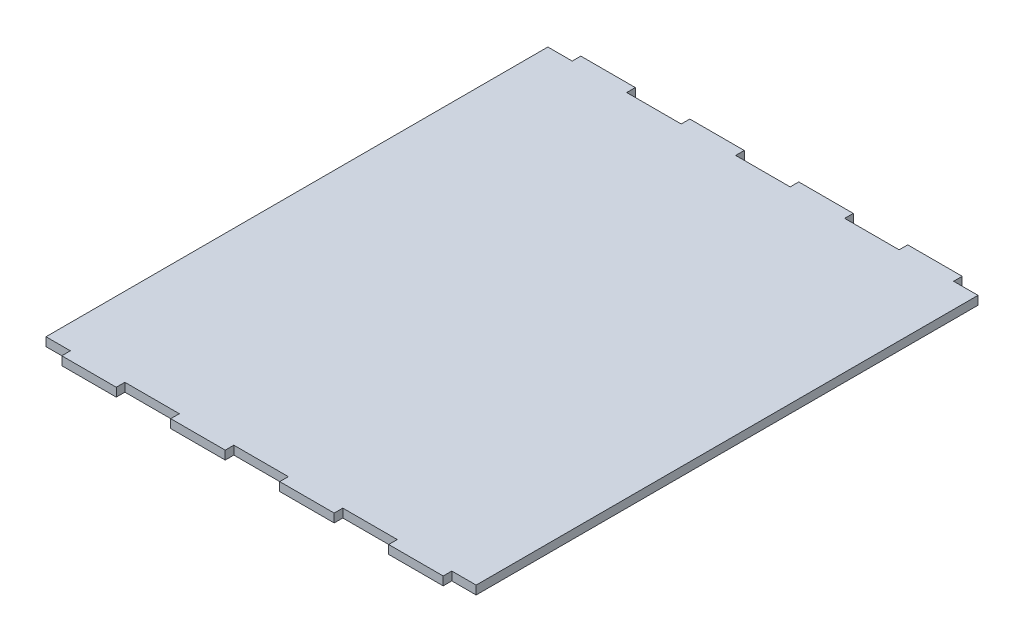
ISO-10303-21;
HEADER;
FILE_DESCRIPTION(('STEP AP214'),'2;1');
FILE_NAME('part.step','',(''),(''),'','','');
FILE_SCHEMA(('AUTOMOTIVE_DESIGN { 1 0 10303 214 1 1 1 1 }'));
ENDSEC;
DATA;
#1=APPLICATION_CONTEXT('core data for automotive mechanical design processes');
#2=APPLICATION_PROTOCOL_DEFINITION('international standard','automotive_design',2000,#1);
#3=PRODUCT_CONTEXT('',#1,'mechanical');
#4=PRODUCT('Part','Part','',(#3));
#5=PRODUCT_RELATED_PRODUCT_CATEGORY('part','',(#4));
#6=PRODUCT_DEFINITION_FORMATION('','',#4);
#7=PRODUCT_DEFINITION_CONTEXT('part definition',#1,'design');
#8=PRODUCT_DEFINITION('design','',#6,#7);
#9=PRODUCT_DEFINITION_SHAPE('','',#8);
#10=(LENGTH_UNIT() NAMED_UNIT(*) SI_UNIT(.MILLI.,.METRE.));
#11=(NAMED_UNIT(*) PLANE_ANGLE_UNIT() SI_UNIT($,.RADIAN.));
#12=(NAMED_UNIT(*) SI_UNIT($,.STERADIAN.) SOLID_ANGLE_UNIT());
#13=UNCERTAINTY_MEASURE_WITH_UNIT(LENGTH_MEASURE(1.E-05),#10,'distance_accuracy_value','');
#14=(GEOMETRIC_REPRESENTATION_CONTEXT(3) GLOBAL_UNCERTAINTY_ASSIGNED_CONTEXT((#13)) GLOBAL_UNIT_ASSIGNED_CONTEXT((#10,
#11,#12)) REPRESENTATION_CONTEXT('',''));
#15=CARTESIAN_POINT('',(0.,0.,0.));
#16=DIRECTION('',(0.,0.,1.));
#17=DIRECTION('',(1.,0.,0.));
#18=AXIS2_PLACEMENT_3D('',#15,#16,#17);
#19=CARTESIAN_POINT('',(0.,3.,-3.));
#20=DIRECTION('',(0.,0.,-1.));
#21=DIRECTION('',(-1.,0.,0.));
#22=AXIS2_PLACEMENT_3D('',#19,#20,#21);
#23=PLANE('',#22);
#24=DIRECTION('',(1.,0.,0.));
#25=VECTOR('',#24,1.);
#26=CARTESIAN_POINT('',(0.,0.,-3.));
#27=LINE('',#26,#25);
#28=CARTESIAN_POINT('',(0.,0.,-3.));
#29=VERTEX_POINT('',#28);
#30=CARTESIAN_POINT('',(8.5,0.,-3.));
#31=VERTEX_POINT('',#30);
#32=EDGE_CURVE('E306',#29,#31,#27,.T.);
#33=ORIENTED_EDGE('',*,*,#32,.T.);
#34=DIRECTION('',(0.,-1.,0.));
#35=VECTOR('',#34,1.);
#36=CARTESIAN_POINT('',(8.5,3.,-3.));
#37=LINE('',#36,#35);
#38=CARTESIAN_POINT('',(8.5,3.,-3.));
#39=VERTEX_POINT('',#38);
#40=EDGE_CURVE('E11',#39,#31,#37,.T.);
#41=ORIENTED_EDGE('',*,*,#40,.F.);
#42=DIRECTION('',(1.,0.,0.));
#43=VECTOR('',#42,1.);
#44=CARTESIAN_POINT('',(0.,3.,-3.));
#45=LINE('',#44,#43);
#46=CARTESIAN_POINT('',(0.,3.,-3.));
#47=VERTEX_POINT('',#46);
#48=EDGE_CURVE('E178',#47,#39,#45,.T.);
#49=ORIENTED_EDGE('',*,*,#48,.F.);
#50=DIRECTION('',(0.,-1.,0.));
#51=VECTOR('',#50,1.);
#52=CARTESIAN_POINT('',(0.,3.,-3.));
#53=LINE('',#52,#51);
#54=EDGE_CURVE('E56',#47,#29,#53,.T.);
#55=ORIENTED_EDGE('',*,*,#54,.T.);
#56=EDGE_LOOP('',(#33,#41,#49,#55));
#57=FACE_BOUND('',#56,.T.);
#58=ADVANCED_FACE('F39',(#57),#23,.F.);
#59=CARTESIAN_POINT('',(8.5,3.,0.));
#60=DIRECTION('',(-1.,0.,0.));
#61=DIRECTION('',(0.,0.,1.));
#62=AXIS2_PLACEMENT_3D('',#59,#60,#61);
#63=PLANE('',#62);
#64=DIRECTION('',(0.,0.,-1.));
#65=VECTOR('',#64,1.);
#66=CARTESIAN_POINT('',(8.5,0.,0.));
#67=LINE('',#66,#65);
#68=CARTESIAN_POINT('',(8.5,0.,0.));
#69=VERTEX_POINT('',#68);
#70=EDGE_CURVE('E309',#69,#31,#67,.T.);
#71=ORIENTED_EDGE('',*,*,#70,.F.);
#72=DIRECTION('',(0.,-1.,0.));
#73=VECTOR('',#72,1.);
#74=CARTESIAN_POINT('',(8.5,3.,0.));
#75=LINE('',#74,#73);
#76=CARTESIAN_POINT('',(8.5,3.,0.));
#77=VERTEX_POINT('',#76);
#78=EDGE_CURVE('E48',#77,#69,#75,.T.);
#79=ORIENTED_EDGE('',*,*,#78,.F.);
#80=DIRECTION('',(0.,0.,-1.));
#81=VECTOR('',#80,1.);
#82=CARTESIAN_POINT('',(8.5,3.,0.));
#83=LINE('',#82,#81);
#84=EDGE_CURVE('E556',#77,#39,#83,.T.);
#85=ORIENTED_EDGE('',*,*,#84,.T.);
#86=ORIENTED_EDGE('',*,*,#40,.T.);
#87=EDGE_LOOP('',(#71,#79,#85,#86));
#88=FACE_BOUND('',#87,.T.);
#89=ADVANCED_FACE('F555',(#88),#63,.T.);
#90=CARTESIAN_POINT('',(8.5,3.,0.));
#91=DIRECTION('',(0.,0.,-1.));
#92=DIRECTION('',(-1.,0.,0.));
#93=AXIS2_PLACEMENT_3D('',#90,#91,#92);
#94=PLANE('',#93);
#95=DIRECTION('',(1.,0.,0.));
#96=VECTOR('',#95,1.);
#97=CARTESIAN_POINT('',(8.5,0.,0.));
#98=LINE('',#97,#96);
#99=CARTESIAN_POINT('',(27.5,0.,0.));
#100=VERTEX_POINT('',#99);
#101=EDGE_CURVE('E313',#69,#100,#98,.T.);
#102=ORIENTED_EDGE('',*,*,#101,.T.);
#103=DIRECTION('',(0.,-1.,0.));
#104=VECTOR('',#103,1.);
#105=CARTESIAN_POINT('',(27.5,3.,0.));
#106=LINE('',#105,#104);
#107=CARTESIAN_POINT('',(27.5,3.,0.));
#108=VERTEX_POINT('',#107);
#109=EDGE_CURVE('E538',#108,#100,#106,.T.);
#110=ORIENTED_EDGE('',*,*,#109,.F.);
#111=DIRECTION('',(1.,0.,0.));
#112=VECTOR('',#111,1.);
#113=CARTESIAN_POINT('',(8.5,3.,0.));
#114=LINE('',#113,#112);
#115=EDGE_CURVE('E547',#77,#108,#114,.T.);
#116=ORIENTED_EDGE('',*,*,#115,.F.);
#117=ORIENTED_EDGE('',*,*,#78,.T.);
#118=EDGE_LOOP('',(#102,#110,#116,#117));
#119=FACE_BOUND('',#118,.T.);
#120=ADVANCED_FACE('F545',(#119),#94,.F.);
#121=CARTESIAN_POINT('',(27.5,3.,0.));
#122=DIRECTION('',(-1.,0.,0.));
#123=DIRECTION('',(0.,0.,1.));
#124=AXIS2_PLACEMENT_3D('',#121,#122,#123);
#125=PLANE('',#124);
#126=DIRECTION('',(0.,0.,-1.));
#127=VECTOR('',#126,1.);
#128=CARTESIAN_POINT('',(27.5,0.,0.));
#129=LINE('',#128,#127);
#130=CARTESIAN_POINT('',(27.5,0.,-3.));
#131=VERTEX_POINT('',#130);
#132=EDGE_CURVE('E316',#100,#131,#129,.T.);
#133=ORIENTED_EDGE('',*,*,#132,.T.);
#134=DIRECTION('',(0.,-1.,0.));
#135=VECTOR('',#134,1.);
#136=CARTESIAN_POINT('',(27.5,3.,-3.));
#137=LINE('',#136,#135);
#138=CARTESIAN_POINT('',(27.5,3.,-3.));
#139=VERTEX_POINT('',#138);
#140=EDGE_CURVE('E534',#139,#131,#137,.T.);
#141=ORIENTED_EDGE('',*,*,#140,.F.);
#142=DIRECTION('',(0.,0.,-1.));
#143=VECTOR('',#142,1.);
#144=CARTESIAN_POINT('',(27.5,3.,0.));
#145=LINE('',#144,#143);
#146=EDGE_CURVE('E1029',#108,#139,#145,.T.);
#147=ORIENTED_EDGE('',*,*,#146,.F.);
#148=ORIENTED_EDGE('',*,*,#109,.T.);
#149=EDGE_LOOP('',(#133,#141,#147,#148));
#150=FACE_BOUND('',#149,.T.);
#151=ADVANCED_FACE('F574',(#150),#125,.F.);
#152=CARTESIAN_POINT('',(27.5,3.,-3.));
#153=DIRECTION('',(0.,0.,-1.));
#154=DIRECTION('',(-1.,0.,0.));
#155=AXIS2_PLACEMENT_3D('',#152,#153,#154);
#156=PLANE('',#155);
#157=DIRECTION('',(1.,0.,0.));
#158=VECTOR('',#157,1.);
#159=CARTESIAN_POINT('',(27.5,0.,-3.));
#160=LINE('',#159,#158);
#161=CARTESIAN_POINT('',(46.5,0.,-3.));
#162=VERTEX_POINT('',#161);
#163=EDGE_CURVE('E319',#131,#162,#160,.T.);
#164=ORIENTED_EDGE('',*,*,#163,.T.);
#165=DIRECTION('',(0.,-1.,0.));
#166=VECTOR('',#165,1.);
#167=CARTESIAN_POINT('',(46.5,3.,-3.));
#168=LINE('',#167,#166);
#169=CARTESIAN_POINT('',(46.5,3.,-3.));
#170=VERTEX_POINT('',#169);
#171=EDGE_CURVE('E531',#170,#162,#168,.T.);
#172=ORIENTED_EDGE('',*,*,#171,.F.);
#173=DIRECTION('',(1.,0.,0.));
#174=VECTOR('',#173,1.);
#175=CARTESIAN_POINT('',(27.5,3.,-3.));
#176=LINE('',#175,#174);
#177=EDGE_CURVE('E1027',#139,#170,#176,.T.);
#178=ORIENTED_EDGE('',*,*,#177,.F.);
#179=ORIENTED_EDGE('',*,*,#140,.T.);
#180=EDGE_LOOP('',(#164,#172,#178,#179));
#181=FACE_BOUND('',#180,.T.);
#182=ADVANCED_FACE('F579',(#181),#156,.F.);
#183=CARTESIAN_POINT('',(46.5,3.,0.));
#184=DIRECTION('',(-1.,0.,0.));
#185=DIRECTION('',(0.,0.,1.));
#186=AXIS2_PLACEMENT_3D('',#183,#184,#185);
#187=PLANE('',#186);
#188=DIRECTION('',(0.,0.,-1.));
#189=VECTOR('',#188,1.);
#190=CARTESIAN_POINT('',(46.5,0.,0.));
#191=LINE('',#190,#189);
#192=CARTESIAN_POINT('',(46.5,0.,0.));
#193=VERTEX_POINT('',#192);
#194=EDGE_CURVE('E323',#193,#162,#191,.T.);
#195=ORIENTED_EDGE('',*,*,#194,.F.);
#196=DIRECTION('',(0.,-1.,0.));
#197=VECTOR('',#196,1.);
#198=CARTESIAN_POINT('',(46.5,3.,0.));
#199=LINE('',#198,#197);
#200=CARTESIAN_POINT('',(46.5,3.,0.));
#201=VERTEX_POINT('',#200);
#202=EDGE_CURVE('E528',#201,#193,#199,.T.);
#203=ORIENTED_EDGE('',*,*,#202,.F.);
#204=DIRECTION('',(0.,0.,-1.));
#205=VECTOR('',#204,1.);
#206=CARTESIAN_POINT('',(46.5,3.,0.));
#207=LINE('',#206,#205);
#208=EDGE_CURVE('E1024',#201,#170,#207,.T.);
#209=ORIENTED_EDGE('',*,*,#208,.T.);
#210=ORIENTED_EDGE('',*,*,#171,.T.);
#211=EDGE_LOOP('',(#195,#203,#209,#210));
#212=FACE_BOUND('',#211,.T.);
#213=ADVANCED_FACE('F583',(#212),#187,.T.);
#214=CARTESIAN_POINT('',(46.5,3.,0.));
#215=DIRECTION('',(0.,0.,-1.));
#216=DIRECTION('',(-1.,0.,0.));
#217=AXIS2_PLACEMENT_3D('',#214,#215,#216);
#218=PLANE('',#217);
#219=DIRECTION('',(1.,0.,0.));
#220=VECTOR('',#219,1.);
#221=CARTESIAN_POINT('',(46.5,0.,0.));
#222=LINE('',#221,#220);
#223=CARTESIAN_POINT('',(65.5,0.,0.));
#224=VERTEX_POINT('',#223);
#225=EDGE_CURVE('E327',#193,#224,#222,.T.);
#226=ORIENTED_EDGE('',*,*,#225,.T.);
#227=DIRECTION('',(0.,-1.,0.));
#228=VECTOR('',#227,1.);
#229=CARTESIAN_POINT('',(65.5,3.,0.));
#230=LINE('',#229,#228);
#231=CARTESIAN_POINT('',(65.5,3.,0.));
#232=VERTEX_POINT('',#231);
#233=EDGE_CURVE('E524',#232,#224,#230,.T.);
#234=ORIENTED_EDGE('',*,*,#233,.F.);
#235=DIRECTION('',(1.,0.,0.));
#236=VECTOR('',#235,1.);
#237=CARTESIAN_POINT('',(46.5,3.,0.));
#238=LINE('',#237,#236);
#239=EDGE_CURVE('E1019',#201,#232,#238,.T.);
#240=ORIENTED_EDGE('',*,*,#239,.F.);
#241=ORIENTED_EDGE('',*,*,#202,.T.);
#242=EDGE_LOOP('',(#226,#234,#240,#241));
#243=FACE_BOUND('',#242,.T.);
#244=ADVANCED_FACE('F587',(#243),#218,.F.);
#245=CARTESIAN_POINT('',(65.5,3.,0.));
#246=DIRECTION('',(-1.,0.,0.));
#247=DIRECTION('',(0.,0.,1.));
#248=AXIS2_PLACEMENT_3D('',#245,#246,#247);
#249=PLANE('',#248);
#250=DIRECTION('',(0.,0.,-1.));
#251=VECTOR('',#250,1.);
#252=CARTESIAN_POINT('',(65.5,0.,0.));
#253=LINE('',#252,#251);
#254=CARTESIAN_POINT('',(65.5,0.,-3.));
#255=VERTEX_POINT('',#254);
#256=EDGE_CURVE('E330',#224,#255,#253,.T.);
#257=ORIENTED_EDGE('',*,*,#256,.T.);
#258=DIRECTION('',(0.,-1.,0.));
#259=VECTOR('',#258,1.);
#260=CARTESIAN_POINT('',(65.5,3.,-3.));
#261=LINE('',#260,#259);
#262=CARTESIAN_POINT('',(65.5,3.,-3.));
#263=VERTEX_POINT('',#262);
#264=EDGE_CURVE('E520',#263,#255,#261,.T.);
#265=ORIENTED_EDGE('',*,*,#264,.F.);
#266=DIRECTION('',(0.,0.,-1.));
#267=VECTOR('',#266,1.);
#268=CARTESIAN_POINT('',(65.5,3.,0.));
#269=LINE('',#268,#267);
#270=EDGE_CURVE('E1016',#232,#263,#269,.T.);
#271=ORIENTED_EDGE('',*,*,#270,.F.);
#272=ORIENTED_EDGE('',*,*,#233,.T.);
#273=EDGE_LOOP('',(#257,#265,#271,#272));
#274=FACE_BOUND('',#273,.T.);
#275=ADVANCED_FACE('F591',(#274),#249,.F.);
#276=CARTESIAN_POINT('',(65.5,3.,-3.));
#277=DIRECTION('',(0.,0.,-1.));
#278=DIRECTION('',(-1.,0.,0.));
#279=AXIS2_PLACEMENT_3D('',#276,#277,#278);
#280=PLANE('',#279);
#281=DIRECTION('',(1.,0.,0.));
#282=VECTOR('',#281,1.);
#283=CARTESIAN_POINT('',(65.5,0.,-3.));
#284=LINE('',#283,#282);
#285=CARTESIAN_POINT('',(84.5,0.,-3.));
#286=VERTEX_POINT('',#285);
#287=EDGE_CURVE('E333',#255,#286,#284,.T.);
#288=ORIENTED_EDGE('',*,*,#287,.T.);
#289=DIRECTION('',(0.,-1.,0.));
#290=VECTOR('',#289,1.);
#291=CARTESIAN_POINT('',(84.5,3.,-3.));
#292=LINE('',#291,#290);
#293=CARTESIAN_POINT('',(84.5,3.,-3.));
#294=VERTEX_POINT('',#293);
#295=EDGE_CURVE('E517',#294,#286,#292,.T.);
#296=ORIENTED_EDGE('',*,*,#295,.F.);
#297=DIRECTION('',(1.,0.,0.));
#298=VECTOR('',#297,1.);
#299=CARTESIAN_POINT('',(65.5,3.,-3.));
#300=LINE('',#299,#298);
#301=EDGE_CURVE('E1014',#263,#294,#300,.T.);
#302=ORIENTED_EDGE('',*,*,#301,.F.);
#303=ORIENTED_EDGE('',*,*,#264,.T.);
#304=EDGE_LOOP('',(#288,#296,#302,#303));
#305=FACE_BOUND('',#304,.T.);
#306=ADVANCED_FACE('F595',(#305),#280,.F.);
#307=CARTESIAN_POINT('',(84.5,3.,0.));
#308=DIRECTION('',(-1.,0.,0.));
#309=DIRECTION('',(0.,0.,1.));
#310=AXIS2_PLACEMENT_3D('',#307,#308,#309);
#311=PLANE('',#310);
#312=DIRECTION('',(0.,0.,-1.));
#313=VECTOR('',#312,1.);
#314=CARTESIAN_POINT('',(84.5,0.,0.));
#315=LINE('',#314,#313);
#316=CARTESIAN_POINT('',(84.5,0.,0.));
#317=VERTEX_POINT('',#316);
#318=EDGE_CURVE('E337',#317,#286,#315,.T.);
#319=ORIENTED_EDGE('',*,*,#318,.F.);
#320=DIRECTION('',(0.,-1.,0.));
#321=VECTOR('',#320,1.);
#322=CARTESIAN_POINT('',(84.5,3.,0.));
#323=LINE('',#322,#321);
#324=CARTESIAN_POINT('',(84.5,3.,0.));
#325=VERTEX_POINT('',#324);
#326=EDGE_CURVE('E514',#325,#317,#323,.T.);
#327=ORIENTED_EDGE('',*,*,#326,.F.);
#328=DIRECTION('',(0.,0.,-1.));
#329=VECTOR('',#328,1.);
#330=CARTESIAN_POINT('',(84.5,3.,0.));
#331=LINE('',#330,#329);
#332=EDGE_CURVE('E1007',#325,#294,#331,.T.);
#333=ORIENTED_EDGE('',*,*,#332,.T.);
#334=ORIENTED_EDGE('',*,*,#295,.T.);
#335=EDGE_LOOP('',(#319,#327,#333,#334));
#336=FACE_BOUND('',#335,.T.);
#337=ADVANCED_FACE('F599',(#336),#311,.T.);
#338=CARTESIAN_POINT('',(84.5,3.,0.));
#339=DIRECTION('',(0.,0.,-1.));
#340=DIRECTION('',(-1.,0.,0.));
#341=AXIS2_PLACEMENT_3D('',#338,#339,#340);
#342=PLANE('',#341);
#343=DIRECTION('',(1.,0.,0.));
#344=VECTOR('',#343,1.);
#345=CARTESIAN_POINT('',(84.5,0.,0.));
#346=LINE('',#345,#344);
#347=CARTESIAN_POINT('',(103.5,0.,0.));
#348=VERTEX_POINT('',#347);
#349=EDGE_CURVE('E341',#317,#348,#346,.T.);
#350=ORIENTED_EDGE('',*,*,#349,.T.);
#351=DIRECTION('',(0.,-1.,0.));
#352=VECTOR('',#351,1.);
#353=CARTESIAN_POINT('',(103.5,3.,0.));
#354=LINE('',#353,#352);
#355=CARTESIAN_POINT('',(103.5,3.,0.));
#356=VERTEX_POINT('',#355);
#357=EDGE_CURVE('E510',#356,#348,#354,.T.);
#358=ORIENTED_EDGE('',*,*,#357,.F.);
#359=DIRECTION('',(1.,0.,0.));
#360=VECTOR('',#359,1.);
#361=CARTESIAN_POINT('',(84.5,3.,0.));
#362=LINE('',#361,#360);
#363=EDGE_CURVE('E1004',#325,#356,#362,.T.);
#364=ORIENTED_EDGE('',*,*,#363,.F.);
#365=ORIENTED_EDGE('',*,*,#326,.T.);
#366=EDGE_LOOP('',(#350,#358,#364,#365));
#367=FACE_BOUND('',#366,.T.);
#368=ADVANCED_FACE('F603',(#367),#342,.F.);
#369=CARTESIAN_POINT('',(103.5,3.,0.));
#370=DIRECTION('',(-1.,0.,0.));
#371=DIRECTION('',(0.,0.,1.));
#372=AXIS2_PLACEMENT_3D('',#369,#370,#371);
#373=PLANE('',#372);
#374=DIRECTION('',(0.,0.,-1.));
#375=VECTOR('',#374,1.);
#376=CARTESIAN_POINT('',(103.5,0.,0.));
#377=LINE('',#376,#375);
#378=CARTESIAN_POINT('',(103.5,0.,-3.));
#379=VERTEX_POINT('',#378);
#380=EDGE_CURVE('E344',#348,#379,#377,.T.);
#381=ORIENTED_EDGE('',*,*,#380,.T.);
#382=DIRECTION('',(0.,-1.,0.));
#383=VECTOR('',#382,1.);
#384=CARTESIAN_POINT('',(103.5,3.,-3.));
#385=LINE('',#384,#383);
#386=CARTESIAN_POINT('',(103.5,3.,-3.));
#387=VERTEX_POINT('',#386);
#388=EDGE_CURVE('E506',#387,#379,#385,.T.);
#389=ORIENTED_EDGE('',*,*,#388,.F.);
#390=DIRECTION('',(0.,0.,-1.));
#391=VECTOR('',#390,1.);
#392=CARTESIAN_POINT('',(103.5,3.,0.));
#393=LINE('',#392,#391);
#394=EDGE_CURVE('E1002',#356,#387,#393,.T.);
#395=ORIENTED_EDGE('',*,*,#394,.F.);
#396=ORIENTED_EDGE('',*,*,#357,.T.);
#397=EDGE_LOOP('',(#381,#389,#395,#396));
#398=FACE_BOUND('',#397,.T.);
#399=ADVANCED_FACE('F607',(#398),#373,.F.);
#400=CARTESIAN_POINT('',(103.5,3.,-3.));
#401=DIRECTION('',(0.,0.,-1.));
#402=DIRECTION('',(-1.,0.,0.));
#403=AXIS2_PLACEMENT_3D('',#400,#401,#402);
#404=PLANE('',#403);
#405=DIRECTION('',(1.,0.,0.));
#406=VECTOR('',#405,1.);
#407=CARTESIAN_POINT('',(103.5,0.,-3.));
#408=LINE('',#407,#406);
#409=CARTESIAN_POINT('',(122.5,0.,-3.));
#410=VERTEX_POINT('',#409);
#411=EDGE_CURVE('E347',#379,#410,#408,.T.);
#412=ORIENTED_EDGE('',*,*,#411,.T.);
#413=DIRECTION('',(0.,-1.,0.));
#414=VECTOR('',#413,1.);
#415=CARTESIAN_POINT('',(122.5,3.,-3.));
#416=LINE('',#415,#414);
#417=CARTESIAN_POINT('',(122.5,3.,-3.));
#418=VERTEX_POINT('',#417);
#419=EDGE_CURVE('E503',#418,#410,#416,.T.);
#420=ORIENTED_EDGE('',*,*,#419,.F.);
#421=DIRECTION('',(1.,0.,0.));
#422=VECTOR('',#421,1.);
#423=CARTESIAN_POINT('',(103.5,3.,-3.));
#424=LINE('',#423,#422);
#425=EDGE_CURVE('E1052',#387,#418,#424,.T.);
#426=ORIENTED_EDGE('',*,*,#425,.F.);
#427=ORIENTED_EDGE('',*,*,#388,.T.);
#428=EDGE_LOOP('',(#412,#420,#426,#427));
#429=FACE_BOUND('',#428,.T.);
#430=ADVANCED_FACE('F611',(#429),#404,.F.);
#431=CARTESIAN_POINT('',(122.5,3.,0.));
#432=DIRECTION('',(-1.,0.,0.));
#433=DIRECTION('',(0.,0.,1.));
#434=AXIS2_PLACEMENT_3D('',#431,#432,#433);
#435=PLANE('',#434);
#436=DIRECTION('',(0.,0.,-1.));
#437=VECTOR('',#436,1.);
#438=CARTESIAN_POINT('',(122.5,0.,0.));
#439=LINE('',#438,#437);
#440=CARTESIAN_POINT('',(122.5,0.,0.));
#441=VERTEX_POINT('',#440);
#442=EDGE_CURVE('E351',#441,#410,#439,.T.);
#443=ORIENTED_EDGE('',*,*,#442,.F.);
#444=DIRECTION('',(0.,-1.,0.));
#445=VECTOR('',#444,1.);
#446=CARTESIAN_POINT('',(122.5,3.,0.));
#447=LINE('',#446,#445);
#448=CARTESIAN_POINT('',(122.5,3.,0.));
#449=VERTEX_POINT('',#448);
#450=EDGE_CURVE('E500',#449,#441,#447,.T.);
#451=ORIENTED_EDGE('',*,*,#450,.F.);
#452=DIRECTION('',(0.,0.,-1.));
#453=VECTOR('',#452,1.);
#454=CARTESIAN_POINT('',(122.5,3.,0.));
#455=LINE('',#454,#453);
#456=EDGE_CURVE('E994',#449,#418,#455,.T.);
#457=ORIENTED_EDGE('',*,*,#456,.T.);
#458=ORIENTED_EDGE('',*,*,#419,.T.);
#459=EDGE_LOOP('',(#443,#451,#457,#458));
#460=FACE_BOUND('',#459,.T.);
#461=ADVANCED_FACE('F615',(#460),#435,.T.);
#462=CARTESIAN_POINT('',(122.5,3.,0.));
#463=DIRECTION('',(0.,0.,-1.));
#464=DIRECTION('',(-1.,0.,0.));
#465=AXIS2_PLACEMENT_3D('',#462,#463,#464);
#466=PLANE('',#465);
#467=DIRECTION('',(1.,0.,0.));
#468=VECTOR('',#467,1.);
#469=CARTESIAN_POINT('',(122.5,0.,0.));
#470=LINE('',#469,#468);
#471=CARTESIAN_POINT('',(141.5,0.,0.));
#472=VERTEX_POINT('',#471);
#473=EDGE_CURVE('E355',#441,#472,#470,.T.);
#474=ORIENTED_EDGE('',*,*,#473,.T.);
#475=DIRECTION('',(0.,-1.,0.));
#476=VECTOR('',#475,1.);
#477=CARTESIAN_POINT('',(141.5,3.,0.));
#478=LINE('',#477,#476);
#479=CARTESIAN_POINT('',(141.5,3.,0.));
#480=VERTEX_POINT('',#479);
#481=EDGE_CURVE('E496',#480,#472,#478,.T.);
#482=ORIENTED_EDGE('',*,*,#481,.F.);
#483=DIRECTION('',(1.,0.,0.));
#484=VECTOR('',#483,1.);
#485=CARTESIAN_POINT('',(122.5,3.,0.));
#486=LINE('',#485,#484);
#487=EDGE_CURVE('E988',#449,#480,#486,.T.);
#488=ORIENTED_EDGE('',*,*,#487,.F.);
#489=ORIENTED_EDGE('',*,*,#450,.T.);
#490=EDGE_LOOP('',(#474,#482,#488,#489));
#491=FACE_BOUND('',#490,.T.);
#492=ADVANCED_FACE('F619',(#491),#466,.F.);
#493=CARTESIAN_POINT('',(141.5,3.,0.));
#494=DIRECTION('',(-1.,0.,0.));
#495=DIRECTION('',(0.,0.,1.));
#496=AXIS2_PLACEMENT_3D('',#493,#494,#495);
#497=PLANE('',#496);
#498=DIRECTION('',(0.,0.,-1.));
#499=VECTOR('',#498,1.);
#500=CARTESIAN_POINT('',(141.5,0.,0.));
#501=LINE('',#500,#499);
#502=CARTESIAN_POINT('',(141.5,0.,-3.));
#503=VERTEX_POINT('',#502);
#504=EDGE_CURVE('E358',#472,#503,#501,.T.);
#505=ORIENTED_EDGE('',*,*,#504,.T.);
#506=DIRECTION('',(0.,-1.,0.));
#507=VECTOR('',#506,1.);
#508=CARTESIAN_POINT('',(141.5,3.,-3.));
#509=LINE('',#508,#507);
#510=CARTESIAN_POINT('',(141.5,3.,-3.));
#511=VERTEX_POINT('',#510);
#512=EDGE_CURVE('E492',#511,#503,#509,.T.);
#513=ORIENTED_EDGE('',*,*,#512,.F.);
#514=DIRECTION('',(0.,0.,-1.));
#515=VECTOR('',#514,1.);
#516=CARTESIAN_POINT('',(141.5,3.,0.));
#517=LINE('',#516,#515);
#518=EDGE_CURVE('E985',#480,#511,#517,.T.);
#519=ORIENTED_EDGE('',*,*,#518,.F.);
#520=ORIENTED_EDGE('',*,*,#481,.T.);
#521=EDGE_LOOP('',(#505,#513,#519,#520));
#522=FACE_BOUND('',#521,.T.);
#523=ADVANCED_FACE('F623',(#522),#497,.F.);
#524=CARTESIAN_POINT('',(141.5,3.,-3.));
#525=DIRECTION('',(0.,0.,-1.));
#526=DIRECTION('',(-1.,0.,0.));
#527=AXIS2_PLACEMENT_3D('',#524,#525,#526);
#528=PLANE('',#527);
#529=DIRECTION('',(1.,0.,0.));
#530=VECTOR('',#529,1.);
#531=CARTESIAN_POINT('',(141.5,0.,-3.));
#532=LINE('',#531,#530);
#533=CARTESIAN_POINT('',(150.,0.,-3.));
#534=VERTEX_POINT('',#533);
#535=EDGE_CURVE('E361',#503,#534,#532,.T.);
#536=ORIENTED_EDGE('',*,*,#535,.T.);
#537=DIRECTION('',(0.,-1.,0.));
#538=VECTOR('',#537,1.);
#539=CARTESIAN_POINT('',(150.,3.,-3.));
#540=LINE('',#539,#538);
#541=CARTESIAN_POINT('',(150.,3.,-3.));
#542=VERTEX_POINT('',#541);
#543=EDGE_CURVE('E488',#542,#534,#540,.T.);
#544=ORIENTED_EDGE('',*,*,#543,.F.);
#545=DIRECTION('',(1.,0.,0.));
#546=VECTOR('',#545,1.);
#547=CARTESIAN_POINT('',(141.5,3.,-3.));
#548=LINE('',#547,#546);
#549=EDGE_CURVE('E983',#511,#542,#548,.T.);
#550=ORIENTED_EDGE('',*,*,#549,.F.);
#551=ORIENTED_EDGE('',*,*,#512,.T.);
#552=EDGE_LOOP('',(#536,#544,#550,#551));
#553=FACE_BOUND('',#552,.T.);
#554=ADVANCED_FACE('F627',(#553),#528,.F.);
#555=CARTESIAN_POINT('',(150.,3.,-3.));
#556=DIRECTION('',(-1.,0.,0.));
#557=DIRECTION('',(0.,0.,1.));
#558=AXIS2_PLACEMENT_3D('',#555,#556,#557);
#559=PLANE('',#558);
#560=DIRECTION('',(0.,0.,-1.));
#561=VECTOR('',#560,1.);
#562=CARTESIAN_POINT('',(150.,0.,-3.));
#563=LINE('',#562,#561);
#564=CARTESIAN_POINT('',(150.,0.,-178.));
#565=VERTEX_POINT('',#564);
#566=EDGE_CURVE('E364',#534,#565,#563,.T.);
#567=ORIENTED_EDGE('',*,*,#566,.T.);
#568=DIRECTION('',(0.,-1.,0.));
#569=VECTOR('',#568,1.);
#570=CARTESIAN_POINT('',(150.,3.,-178.));
#571=LINE('',#570,#569);
#572=CARTESIAN_POINT('',(150.,3.,-178.));
#573=VERTEX_POINT('',#572);
#574=EDGE_CURVE('E485',#573,#565,#571,.T.);
#575=ORIENTED_EDGE('',*,*,#574,.F.);
#576=DIRECTION('',(0.,0.,-1.));
#577=VECTOR('',#576,1.);
#578=CARTESIAN_POINT('',(150.,3.,-3.));
#579=LINE('',#578,#577);
#580=EDGE_CURVE('E1063',#542,#573,#579,.T.);
#581=ORIENTED_EDGE('',*,*,#580,.F.);
#582=ORIENTED_EDGE('',*,*,#543,.T.);
#583=EDGE_LOOP('',(#567,#575,#581,#582));
#584=FACE_BOUND('',#583,.T.);
#585=ADVANCED_FACE('F631',(#584),#559,.F.);
#586=CARTESIAN_POINT('',(141.5,3.,-178.));
#587=DIRECTION('',(0.,0.,-1.));
#588=DIRECTION('',(-1.,0.,0.));
#589=AXIS2_PLACEMENT_3D('',#586,#587,#588);
#590=PLANE('',#589);
#591=DIRECTION('',(1.,0.,0.));
#592=VECTOR('',#591,1.);
#593=CARTESIAN_POINT('',(141.5,0.,-178.));
#594=LINE('',#593,#592);
#595=CARTESIAN_POINT('',(141.5,0.,-178.));
#596=VERTEX_POINT('',#595);
#597=EDGE_CURVE('E368',#596,#565,#594,.T.);
#598=ORIENTED_EDGE('',*,*,#597,.F.);
#599=DIRECTION('',(0.,-1.,0.));
#600=VECTOR('',#599,1.);
#601=CARTESIAN_POINT('',(141.5,3.,-178.));
#602=LINE('',#601,#600);
#603=CARTESIAN_POINT('',(141.5,3.,-178.));
#604=VERTEX_POINT('',#603);
#605=EDGE_CURVE('E482',#604,#596,#602,.T.);
#606=ORIENTED_EDGE('',*,*,#605,.F.);
#607=DIRECTION('',(1.,0.,0.));
#608=VECTOR('',#607,1.);
#609=CARTESIAN_POINT('',(141.5,3.,-178.));
#610=LINE('',#609,#608);
#611=EDGE_CURVE('E975',#604,#573,#610,.T.);
#612=ORIENTED_EDGE('',*,*,#611,.T.);
#613=ORIENTED_EDGE('',*,*,#574,.T.);
#614=EDGE_LOOP('',(#598,#606,#612,#613));
#615=FACE_BOUND('',#614,.T.);
#616=ADVANCED_FACE('F635',(#615),#590,.T.);
#617=CARTESIAN_POINT('',(141.5,3.,-181.));
#618=DIRECTION('',(1.,0.,0.));
#619=DIRECTION('',(0.,0.,-1.));
#620=AXIS2_PLACEMENT_3D('',#617,#618,#619);
#621=PLANE('',#620);
#622=DIRECTION('',(0.,0.,1.));
#623=VECTOR('',#622,1.);
#624=CARTESIAN_POINT('',(141.5,0.,-181.));
#625=LINE('',#624,#623);
#626=CARTESIAN_POINT('',(141.5,0.,-181.));
#627=VERTEX_POINT('',#626);
#628=EDGE_CURVE('E372',#627,#596,#625,.T.);
#629=ORIENTED_EDGE('',*,*,#628,.F.);
#630=DIRECTION('',(0.,-1.,0.));
#631=VECTOR('',#630,1.);
#632=CARTESIAN_POINT('',(141.5,3.,-181.));
#633=LINE('',#632,#631);
#634=CARTESIAN_POINT('',(141.5,3.,-181.));
#635=VERTEX_POINT('',#634);
#636=EDGE_CURVE('E479',#635,#627,#633,.T.);
#637=ORIENTED_EDGE('',*,*,#636,.F.);
#638=DIRECTION('',(0.,0.,1.));
#639=VECTOR('',#638,1.);
#640=CARTESIAN_POINT('',(141.5,3.,-181.));
#641=LINE('',#640,#639);
#642=EDGE_CURVE('E971',#635,#604,#641,.T.);
#643=ORIENTED_EDGE('',*,*,#642,.T.);
#644=ORIENTED_EDGE('',*,*,#605,.T.);
#645=EDGE_LOOP('',(#629,#637,#643,#644));
#646=FACE_BOUND('',#645,.T.);
#647=ADVANCED_FACE('F639',(#646),#621,.T.);
#648=CARTESIAN_POINT('',(122.5,3.,-181.));
#649=DIRECTION('',(0.,0.,-1.));
#650=DIRECTION('',(-1.,0.,0.));
#651=AXIS2_PLACEMENT_3D('',#648,#649,#650);
#652=PLANE('',#651);
#653=DIRECTION('',(1.,0.,0.));
#654=VECTOR('',#653,1.);
#655=CARTESIAN_POINT('',(122.5,0.,-181.));
#656=LINE('',#655,#654);
#657=CARTESIAN_POINT('',(122.5,0.,-181.));
#658=VERTEX_POINT('',#657);
#659=EDGE_CURVE('E376',#658,#627,#656,.T.);
#660=ORIENTED_EDGE('',*,*,#659,.F.);
#661=DIRECTION('',(0.,-1.,0.));
#662=VECTOR('',#661,1.);
#663=CARTESIAN_POINT('',(122.5,3.,-181.));
#664=LINE('',#663,#662);
#665=CARTESIAN_POINT('',(122.5,3.,-181.));
#666=VERTEX_POINT('',#665);
#667=EDGE_CURVE('E476',#666,#658,#664,.T.);
#668=ORIENTED_EDGE('',*,*,#667,.F.);
#669=DIRECTION('',(1.,0.,0.));
#670=VECTOR('',#669,1.);
#671=CARTESIAN_POINT('',(122.5,3.,-181.));
#672=LINE('',#671,#670);
#673=EDGE_CURVE('E965',#666,#635,#672,.T.);
#674=ORIENTED_EDGE('',*,*,#673,.T.);
#675=ORIENTED_EDGE('',*,*,#636,.T.);
#676=EDGE_LOOP('',(#660,#668,#674,#675));
#677=FACE_BOUND('',#676,.T.);
#678=ADVANCED_FACE('F643',(#677),#652,.T.);
#679=CARTESIAN_POINT('',(122.5,3.,-181.));
#680=DIRECTION('',(1.,0.,0.));
#681=DIRECTION('',(0.,0.,-1.));
#682=AXIS2_PLACEMENT_3D('',#679,#680,#681);
#683=PLANE('',#682);
#684=DIRECTION('',(0.,0.,1.));
#685=VECTOR('',#684,1.);
#686=CARTESIAN_POINT('',(122.5,0.,-181.));
#687=LINE('',#686,#685);
#688=CARTESIAN_POINT('',(122.5,0.,-178.));
#689=VERTEX_POINT('',#688);
#690=EDGE_CURVE('E380',#658,#689,#687,.T.);
#691=ORIENTED_EDGE('',*,*,#690,.T.);
#692=DIRECTION('',(0.,-1.,0.));
#693=VECTOR('',#692,1.);
#694=CARTESIAN_POINT('',(122.5,3.,-178.));
#695=LINE('',#694,#693);
#696=CARTESIAN_POINT('',(122.5,3.,-178.));
#697=VERTEX_POINT('',#696);
#698=EDGE_CURVE('E473',#697,#689,#695,.T.);
#699=ORIENTED_EDGE('',*,*,#698,.F.);
#700=DIRECTION('',(0.,0.,1.));
#701=VECTOR('',#700,1.);
#702=CARTESIAN_POINT('',(122.5,3.,-181.));
#703=LINE('',#702,#701);
#704=EDGE_CURVE('E962',#666,#697,#703,.T.);
#705=ORIENTED_EDGE('',*,*,#704,.F.);
#706=ORIENTED_EDGE('',*,*,#667,.T.);
#707=EDGE_LOOP('',(#691,#699,#705,#706));
#708=FACE_BOUND('',#707,.T.);
#709=ADVANCED_FACE('F647',(#708),#683,.F.);
#710=CARTESIAN_POINT('',(103.5,3.,-178.));
#711=DIRECTION('',(0.,0.,-1.));
#712=DIRECTION('',(-1.,0.,0.));
#713=AXIS2_PLACEMENT_3D('',#710,#711,#712);
#714=PLANE('',#713);
#715=DIRECTION('',(1.,0.,0.));
#716=VECTOR('',#715,1.);
#717=CARTESIAN_POINT('',(103.5,0.,-178.));
#718=LINE('',#717,#716);
#719=CARTESIAN_POINT('',(103.5,0.,-178.));
#720=VERTEX_POINT('',#719);
#721=EDGE_CURVE('E384',#720,#689,#718,.T.);
#722=ORIENTED_EDGE('',*,*,#721,.F.);
#723=DIRECTION('',(0.,-1.,0.));
#724=VECTOR('',#723,1.);
#725=CARTESIAN_POINT('',(103.5,3.,-178.));
#726=LINE('',#725,#724);
#727=CARTESIAN_POINT('',(103.5,3.,-178.));
#728=VERTEX_POINT('',#727);
#729=EDGE_CURVE('E470',#728,#720,#726,.T.);
#730=ORIENTED_EDGE('',*,*,#729,.F.);
#731=DIRECTION('',(1.,0.,0.));
#732=VECTOR('',#731,1.);
#733=CARTESIAN_POINT('',(103.5,3.,-178.));
#734=LINE('',#733,#732);
#735=EDGE_CURVE('E960',#728,#697,#734,.T.);
#736=ORIENTED_EDGE('',*,*,#735,.T.);
#737=ORIENTED_EDGE('',*,*,#698,.T.);
#738=EDGE_LOOP('',(#722,#730,#736,#737));
#739=FACE_BOUND('',#738,.T.);
#740=ADVANCED_FACE('F651',(#739),#714,.T.);
#741=CARTESIAN_POINT('',(103.5,3.,-181.));
#742=DIRECTION('',(1.,0.,0.));
#743=DIRECTION('',(0.,0.,-1.));
#744=AXIS2_PLACEMENT_3D('',#741,#742,#743);
#745=PLANE('',#744);
#746=DIRECTION('',(0.,0.,1.));
#747=VECTOR('',#746,1.);
#748=CARTESIAN_POINT('',(103.5,0.,-181.));
#749=LINE('',#748,#747);
#750=CARTESIAN_POINT('',(103.5,0.,-181.));
#751=VERTEX_POINT('',#750);
#752=EDGE_CURVE('E388',#751,#720,#749,.T.);
#753=ORIENTED_EDGE('',*,*,#752,.F.);
#754=DIRECTION('',(0.,-1.,0.));
#755=VECTOR('',#754,1.);
#756=CARTESIAN_POINT('',(103.5,3.,-181.));
#757=LINE('',#756,#755);
#758=CARTESIAN_POINT('',(103.5,3.,-181.));
#759=VERTEX_POINT('',#758);
#760=EDGE_CURVE('E467',#759,#751,#757,.T.);
#761=ORIENTED_EDGE('',*,*,#760,.F.);
#762=DIRECTION('',(0.,0.,1.));
#763=VECTOR('',#762,1.);
#764=CARTESIAN_POINT('',(103.5,3.,-181.));
#765=LINE('',#764,#763);
#766=EDGE_CURVE('E1076',#759,#728,#765,.T.);
#767=ORIENTED_EDGE('',*,*,#766,.T.);
#768=ORIENTED_EDGE('',*,*,#729,.T.);
#769=EDGE_LOOP('',(#753,#761,#767,#768));
#770=FACE_BOUND('',#769,.T.);
#771=ADVANCED_FACE('F655',(#770),#745,.T.);
#772=CARTESIAN_POINT('',(84.5,3.,-181.));
#773=DIRECTION('',(0.,0.,-1.));
#774=DIRECTION('',(-1.,0.,0.));
#775=AXIS2_PLACEMENT_3D('',#772,#773,#774);
#776=PLANE('',#775);
#777=DIRECTION('',(1.,0.,0.));
#778=VECTOR('',#777,1.);
#779=CARTESIAN_POINT('',(84.5,0.,-181.));
#780=LINE('',#779,#778);
#781=CARTESIAN_POINT('',(84.5,0.,-181.));
#782=VERTEX_POINT('',#781);
#783=EDGE_CURVE('E392',#782,#751,#780,.T.);
#784=ORIENTED_EDGE('',*,*,#783,.F.);
#785=DIRECTION('',(0.,-1.,0.));
#786=VECTOR('',#785,1.);
#787=CARTESIAN_POINT('',(84.5,3.,-181.));
#788=LINE('',#787,#786);
#789=CARTESIAN_POINT('',(84.5,3.,-181.));
#790=VERTEX_POINT('',#789);
#791=EDGE_CURVE('E464',#790,#782,#788,.T.);
#792=ORIENTED_EDGE('',*,*,#791,.F.);
#793=DIRECTION('',(1.,0.,0.));
#794=VECTOR('',#793,1.);
#795=CARTESIAN_POINT('',(84.5,3.,-181.));
#796=LINE('',#795,#794);
#797=EDGE_CURVE('E951',#790,#759,#796,.T.);
#798=ORIENTED_EDGE('',*,*,#797,.T.);
#799=ORIENTED_EDGE('',*,*,#760,.T.);
#800=EDGE_LOOP('',(#784,#792,#798,#799));
#801=FACE_BOUND('',#800,.T.);
#802=ADVANCED_FACE('F659',(#801),#776,.T.);
#803=CARTESIAN_POINT('',(84.5,3.,-178.));
#804=DIRECTION('',(-1.,0.,0.));
#805=DIRECTION('',(0.,0.,1.));
#806=AXIS2_PLACEMENT_3D('',#803,#804,#805);
#807=PLANE('',#806);
#808=DIRECTION('',(0.,0.,-1.));
#809=VECTOR('',#808,1.);
#810=CARTESIAN_POINT('',(84.5,0.,-178.));
#811=LINE('',#810,#809);
#812=CARTESIAN_POINT('',(84.5,0.,-178.));
#813=VERTEX_POINT('',#812);
#814=EDGE_CURVE('E396',#813,#782,#811,.T.);
#815=ORIENTED_EDGE('',*,*,#814,.F.);
#816=DIRECTION('',(0.,-1.,0.));
#817=VECTOR('',#816,1.);
#818=CARTESIAN_POINT('',(84.5,3.,-178.));
#819=LINE('',#818,#817);
#820=CARTESIAN_POINT('',(84.5,3.,-178.));
#821=VERTEX_POINT('',#820);
#822=EDGE_CURVE('E461',#821,#813,#819,.T.);
#823=ORIENTED_EDGE('',*,*,#822,.F.);
#824=DIRECTION('',(0.,0.,-1.));
#825=VECTOR('',#824,1.);
#826=CARTESIAN_POINT('',(84.5,3.,-178.));
#827=LINE('',#826,#825);
#828=EDGE_CURVE('E947',#821,#790,#827,.T.);
#829=ORIENTED_EDGE('',*,*,#828,.T.);
#830=ORIENTED_EDGE('',*,*,#791,.T.);
#831=EDGE_LOOP('',(#815,#823,#829,#830));
#832=FACE_BOUND('',#831,.T.);
#833=ADVANCED_FACE('F663',(#832),#807,.T.);
#834=CARTESIAN_POINT('',(65.5,3.,-178.));
#835=DIRECTION('',(0.,0.,-1.));
#836=DIRECTION('',(-1.,0.,0.));
#837=AXIS2_PLACEMENT_3D('',#834,#835,#836);
#838=PLANE('',#837);
#839=DIRECTION('',(1.,0.,0.));
#840=VECTOR('',#839,1.);
#841=CARTESIAN_POINT('',(65.5,0.,-178.));
#842=LINE('',#841,#840);
#843=CARTESIAN_POINT('',(65.5,0.,-178.));
#844=VERTEX_POINT('',#843);
#845=EDGE_CURVE('E400',#844,#813,#842,.T.);
#846=ORIENTED_EDGE('',*,*,#845,.F.);
#847=DIRECTION('',(0.,-1.,0.));
#848=VECTOR('',#847,1.);
#849=CARTESIAN_POINT('',(65.5,3.,-178.));
#850=LINE('',#849,#848);
#851=CARTESIAN_POINT('',(65.5,3.,-178.));
#852=VERTEX_POINT('',#851);
#853=EDGE_CURVE('E458',#852,#844,#850,.T.);
#854=ORIENTED_EDGE('',*,*,#853,.F.);
#855=DIRECTION('',(1.,0.,0.));
#856=VECTOR('',#855,1.);
#857=CARTESIAN_POINT('',(65.5,3.,-178.));
#858=LINE('',#857,#856);
#859=EDGE_CURVE('E942',#852,#821,#858,.T.);
#860=ORIENTED_EDGE('',*,*,#859,.T.);
#861=ORIENTED_EDGE('',*,*,#822,.T.);
#862=EDGE_LOOP('',(#846,#854,#860,#861));
#863=FACE_BOUND('',#862,.T.);
#864=ADVANCED_FACE('F667',(#863),#838,.T.);
#865=CARTESIAN_POINT('',(65.5,3.,-178.));
#866=DIRECTION('',(-1.,0.,0.));
#867=DIRECTION('',(0.,0.,1.));
#868=AXIS2_PLACEMENT_3D('',#865,#866,#867);
#869=PLANE('',#868);
#870=DIRECTION('',(0.,0.,-1.));
#871=VECTOR('',#870,1.);
#872=CARTESIAN_POINT('',(65.5,0.,-178.));
#873=LINE('',#872,#871);
#874=CARTESIAN_POINT('',(65.5,0.,-181.));
#875=VERTEX_POINT('',#874);
#876=EDGE_CURVE('E404',#844,#875,#873,.T.);
#877=ORIENTED_EDGE('',*,*,#876,.T.);
#878=DIRECTION('',(0.,-1.,0.));
#879=VECTOR('',#878,1.);
#880=CARTESIAN_POINT('',(65.5,3.,-181.));
#881=LINE('',#880,#879);
#882=CARTESIAN_POINT('',(65.5,3.,-181.));
#883=VERTEX_POINT('',#882);
#884=EDGE_CURVE('E455',#883,#875,#881,.T.);
#885=ORIENTED_EDGE('',*,*,#884,.F.);
#886=DIRECTION('',(0.,0.,-1.));
#887=VECTOR('',#886,1.);
#888=CARTESIAN_POINT('',(65.5,3.,-178.));
#889=LINE('',#888,#887);
#890=EDGE_CURVE('E939',#852,#883,#889,.T.);
#891=ORIENTED_EDGE('',*,*,#890,.F.);
#892=ORIENTED_EDGE('',*,*,#853,.T.);
#893=EDGE_LOOP('',(#877,#885,#891,#892));
#894=FACE_BOUND('',#893,.T.);
#895=ADVANCED_FACE('F671',(#894),#869,.F.);
#896=CARTESIAN_POINT('',(46.5,3.,-181.));
#897=DIRECTION('',(0.,0.,-1.));
#898=DIRECTION('',(-1.,0.,0.));
#899=AXIS2_PLACEMENT_3D('',#896,#897,#898);
#900=PLANE('',#899);
#901=DIRECTION('',(1.,0.,0.));
#902=VECTOR('',#901,1.);
#903=CARTESIAN_POINT('',(46.5,0.,-181.));
#904=LINE('',#903,#902);
#905=CARTESIAN_POINT('',(46.5,0.,-181.));
#906=VERTEX_POINT('',#905);
#907=EDGE_CURVE('E408',#906,#875,#904,.T.);
#908=ORIENTED_EDGE('',*,*,#907,.F.);
#909=DIRECTION('',(0.,-1.,0.));
#910=VECTOR('',#909,1.);
#911=CARTESIAN_POINT('',(46.5,3.,-181.));
#912=LINE('',#911,#910);
#913=CARTESIAN_POINT('',(46.5,3.,-181.));
#914=VERTEX_POINT('',#913);
#915=EDGE_CURVE('E452',#914,#906,#912,.T.);
#916=ORIENTED_EDGE('',*,*,#915,.F.);
#917=DIRECTION('',(1.,0.,0.));
#918=VECTOR('',#917,1.);
#919=CARTESIAN_POINT('',(46.5,3.,-181.));
#920=LINE('',#919,#918);
#921=EDGE_CURVE('E937',#914,#883,#920,.T.);
#922=ORIENTED_EDGE('',*,*,#921,.T.);
#923=ORIENTED_EDGE('',*,*,#884,.T.);
#924=EDGE_LOOP('',(#908,#916,#922,#923));
#925=FACE_BOUND('',#924,.T.);
#926=ADVANCED_FACE('F675',(#925),#900,.T.);
#927=CARTESIAN_POINT('',(46.5,3.,-178.));
#928=DIRECTION('',(-1.,0.,0.));
#929=DIRECTION('',(0.,0.,1.));
#930=AXIS2_PLACEMENT_3D('',#927,#928,#929);
#931=PLANE('',#930);
#932=DIRECTION('',(0.,0.,-1.));
#933=VECTOR('',#932,1.);
#934=CARTESIAN_POINT('',(46.5,0.,-178.));
#935=LINE('',#934,#933);
#936=CARTESIAN_POINT('',(46.5,0.,-178.));
#937=VERTEX_POINT('',#936);
#938=EDGE_CURVE('E412',#937,#906,#935,.T.);
#939=ORIENTED_EDGE('',*,*,#938,.F.);
#940=DIRECTION('',(0.,-1.,0.));
#941=VECTOR('',#940,1.);
#942=CARTESIAN_POINT('',(46.5,3.,-178.));
#943=LINE('',#942,#941);
#944=CARTESIAN_POINT('',(46.5,3.,-178.));
#945=VERTEX_POINT('',#944);
#946=EDGE_CURVE('E449',#945,#937,#943,.T.);
#947=ORIENTED_EDGE('',*,*,#946,.F.);
#948=DIRECTION('',(0.,0.,-1.));
#949=VECTOR('',#948,1.);
#950=CARTESIAN_POINT('',(46.5,3.,-178.));
#951=LINE('',#950,#949);
#952=EDGE_CURVE('E1089',#945,#914,#951,.T.);
#953=ORIENTED_EDGE('',*,*,#952,.T.);
#954=ORIENTED_EDGE('',*,*,#915,.T.);
#955=EDGE_LOOP('',(#939,#947,#953,#954));
#956=FACE_BOUND('',#955,.T.);
#957=ADVANCED_FACE('F679',(#956),#931,.T.);
#958=CARTESIAN_POINT('',(27.5,3.,-178.));
#959=DIRECTION('',(0.,0.,-1.));
#960=DIRECTION('',(-1.,0.,0.));
#961=AXIS2_PLACEMENT_3D('',#958,#959,#960);
#962=PLANE('',#961);
#963=DIRECTION('',(1.,0.,0.));
#964=VECTOR('',#963,1.);
#965=CARTESIAN_POINT('',(27.5,0.,-178.));
#966=LINE('',#965,#964);
#967=CARTESIAN_POINT('',(27.5,0.,-178.));
#968=VERTEX_POINT('',#967);
#969=EDGE_CURVE('E416',#968,#937,#966,.T.);
#970=ORIENTED_EDGE('',*,*,#969,.F.);
#971=DIRECTION('',(0.,-1.,0.));
#972=VECTOR('',#971,1.);
#973=CARTESIAN_POINT('',(27.5,3.,-178.));
#974=LINE('',#973,#972);
#975=CARTESIAN_POINT('',(27.5,3.,-178.));
#976=VERTEX_POINT('',#975);
#977=EDGE_CURVE('E446',#976,#968,#974,.T.);
#978=ORIENTED_EDGE('',*,*,#977,.F.);
#979=DIRECTION('',(1.,0.,0.));
#980=VECTOR('',#979,1.);
#981=CARTESIAN_POINT('',(27.5,3.,-178.));
#982=LINE('',#981,#980);
#983=EDGE_CURVE('E928',#976,#945,#982,.T.);
#984=ORIENTED_EDGE('',*,*,#983,.T.);
#985=ORIENTED_EDGE('',*,*,#946,.T.);
#986=EDGE_LOOP('',(#970,#978,#984,#985));
#987=FACE_BOUND('',#986,.T.);
#988=ADVANCED_FACE('F683',(#987),#962,.T.);
#989=CARTESIAN_POINT('',(27.5,3.,-178.));
#990=DIRECTION('',(-1.,0.,0.));
#991=DIRECTION('',(0.,0.,1.));
#992=AXIS2_PLACEMENT_3D('',#989,#990,#991);
#993=PLANE('',#992);
#994=DIRECTION('',(0.,0.,-1.));
#995=VECTOR('',#994,1.);
#996=CARTESIAN_POINT('',(27.5,0.,-178.));
#997=LINE('',#996,#995);
#998=CARTESIAN_POINT('',(27.5,0.,-181.));
#999=VERTEX_POINT('',#998);
#1000=EDGE_CURVE('E420',#968,#999,#997,.T.);
#1001=ORIENTED_EDGE('',*,*,#1000,.T.);
#1002=DIRECTION('',(0.,-1.,0.));
#1003=VECTOR('',#1002,1.);
#1004=CARTESIAN_POINT('',(27.5,3.,-181.));
#1005=LINE('',#1004,#1003);
#1006=CARTESIAN_POINT('',(27.5,3.,-181.));
#1007=VERTEX_POINT('',#1006);
#1008=EDGE_CURVE('E443',#1007,#999,#1005,.T.);
#1009=ORIENTED_EDGE('',*,*,#1008,.F.);
#1010=DIRECTION('',(0.,0.,-1.));
#1011=VECTOR('',#1010,1.);
#1012=CARTESIAN_POINT('',(27.5,3.,-178.));
#1013=LINE('',#1012,#1011);
#1014=EDGE_CURVE('E1094',#976,#1007,#1013,.T.);
#1015=ORIENTED_EDGE('',*,*,#1014,.F.);
#1016=ORIENTED_EDGE('',*,*,#977,.T.);
#1017=EDGE_LOOP('',(#1001,#1009,#1015,#1016));
#1018=FACE_BOUND('',#1017,.T.);
#1019=ADVANCED_FACE('F687',(#1018),#993,.F.);
#1020=CARTESIAN_POINT('',(8.49999999999999,3.,-181.));
#1021=DIRECTION('',(0.,0.,-1.));
#1022=DIRECTION('',(-1.,0.,0.));
#1023=AXIS2_PLACEMENT_3D('',#1020,#1021,#1022);
#1024=PLANE('',#1023);
#1025=DIRECTION('',(1.,0.,0.));
#1026=VECTOR('',#1025,1.);
#1027=CARTESIAN_POINT('',(8.49999999999999,0.,-181.));
#1028=LINE('',#1027,#1026);
#1029=CARTESIAN_POINT('',(8.49999999999999,0.,-181.));
#1030=VERTEX_POINT('',#1029);
#1031=EDGE_CURVE('E424',#1030,#999,#1028,.T.);
#1032=ORIENTED_EDGE('',*,*,#1031,.F.);
#1033=DIRECTION('',(0.,-1.,0.));
#1034=VECTOR('',#1033,1.);
#1035=CARTESIAN_POINT('',(8.49999999999999,3.,-181.));
#1036=LINE('',#1035,#1034);
#1037=CARTESIAN_POINT('',(8.49999999999999,3.,-181.));
#1038=VERTEX_POINT('',#1037);
#1039=EDGE_CURVE('E296',#1038,#1030,#1036,.T.);
#1040=ORIENTED_EDGE('',*,*,#1039,.F.);
#1041=DIRECTION('',(1.,0.,0.));
#1042=VECTOR('',#1041,1.);
#1043=CARTESIAN_POINT('',(8.49999999999999,3.,-181.));
#1044=LINE('',#1043,#1042);
#1045=EDGE_CURVE('E284',#1038,#1007,#1044,.T.);
#1046=ORIENTED_EDGE('',*,*,#1045,.T.);
#1047=ORIENTED_EDGE('',*,*,#1008,.T.);
#1048=EDGE_LOOP('',(#1032,#1040,#1046,#1047));
#1049=FACE_BOUND('',#1048,.T.);
#1050=ADVANCED_FACE('F691',(#1049),#1024,.T.);
#1051=CARTESIAN_POINT('',(8.49999999999999,3.,-181.));
#1052=DIRECTION('',(1.,0.,0.));
#1053=DIRECTION('',(0.,0.,-1.));
#1054=AXIS2_PLACEMENT_3D('',#1051,#1052,#1053);
#1055=PLANE('',#1054);
#1056=DIRECTION('',(0.,0.,1.));
#1057=VECTOR('',#1056,1.);
#1058=CARTESIAN_POINT('',(8.49999999999999,0.,-181.));
#1059=LINE('',#1058,#1057);
#1060=CARTESIAN_POINT('',(8.50000000000001,0.,-178.));
#1061=VERTEX_POINT('',#1060);
#1062=EDGE_CURVE('E292',#1030,#1061,#1059,.T.);
#1063=ORIENTED_EDGE('',*,*,#1062,.T.);
#1064=DIRECTION('',(0.,-1.,0.));
#1065=VECTOR('',#1064,1.);
#1066=CARTESIAN_POINT('',(8.50000000000001,3.,-178.));
#1067=LINE('',#1066,#1065);
#1068=CARTESIAN_POINT('',(8.50000000000001,3.,-178.));
#1069=VERTEX_POINT('',#1068);
#1070=EDGE_CURVE('E289',#1069,#1061,#1067,.T.);
#1071=ORIENTED_EDGE('',*,*,#1070,.F.);
#1072=DIRECTION('',(0.,0.,1.));
#1073=VECTOR('',#1072,1.);
#1074=CARTESIAN_POINT('',(8.49999999999999,3.,-181.));
#1075=LINE('',#1074,#1073);
#1076=EDGE_CURVE('E278',#1038,#1069,#1075,.T.);
#1077=ORIENTED_EDGE('',*,*,#1076,.F.);
#1078=ORIENTED_EDGE('',*,*,#1039,.T.);
#1079=EDGE_LOOP('',(#1063,#1071,#1077,#1078));
#1080=FACE_BOUND('',#1079,.T.);
#1081=ADVANCED_FACE('F290',(#1080),#1055,.F.);
#1082=CARTESIAN_POINT('',(8.50000000000001,3.,-178.));
#1083=DIRECTION('',(0.,0.,1.));
#1084=DIRECTION('',(1.,0.,0.));
#1085=AXIS2_PLACEMENT_3D('',#1082,#1083,#1084);
#1086=PLANE('',#1085);
#1087=DIRECTION('',(-1.,0.,0.));
#1088=VECTOR('',#1087,1.);
#1089=CARTESIAN_POINT('',(8.50000000000001,0.,-178.));
#1090=LINE('',#1089,#1088);
#1091=CARTESIAN_POINT('',(0.,0.,-178.));
#1092=VERTEX_POINT('',#1091);
#1093=EDGE_CURVE('E430',#1061,#1092,#1090,.T.);
#1094=ORIENTED_EDGE('',*,*,#1093,.T.);
#1095=DIRECTION('',(0.,-1.,0.));
#1096=VECTOR('',#1095,1.);
#1097=CARTESIAN_POINT('',(0.,3.,-178.));
#1098=LINE('',#1097,#1096);
#1099=CARTESIAN_POINT('',(0.,3.,-178.));
#1100=VERTEX_POINT('',#1099);
#1101=EDGE_CURVE('E166',#1100,#1092,#1098,.T.);
#1102=ORIENTED_EDGE('',*,*,#1101,.F.);
#1103=DIRECTION('',(-1.,0.,0.));
#1104=VECTOR('',#1103,1.);
#1105=CARTESIAN_POINT('',(8.50000000000001,3.,-178.));
#1106=LINE('',#1105,#1104);
#1107=EDGE_CURVE('E282',#1069,#1100,#1106,.T.);
#1108=ORIENTED_EDGE('',*,*,#1107,.F.);
#1109=ORIENTED_EDGE('',*,*,#1070,.T.);
#1110=EDGE_LOOP('',(#1094,#1102,#1108,#1109));
#1111=FACE_BOUND('',#1110,.T.);
#1112=ADVANCED_FACE('F298',(#1111),#1086,.F.);
#1113=CARTESIAN_POINT('',(0.,3.,-3.));
#1114=DIRECTION('',(-1.,0.,0.));
#1115=DIRECTION('',(0.,0.,1.));
#1116=AXIS2_PLACEMENT_3D('',#1113,#1114,#1115);
#1117=PLANE('',#1116);
#1118=DIRECTION('',(0.,0.,-1.));
#1119=VECTOR('',#1118,1.);
#1120=CARTESIAN_POINT('',(0.,0.,-3.));
#1121=LINE('',#1120,#1119);
#1122=EDGE_CURVE('E433',#29,#1092,#1121,.T.);
#1123=ORIENTED_EDGE('',*,*,#1122,.F.);
#1124=ORIENTED_EDGE('',*,*,#54,.F.);
#1125=DIRECTION('',(0.,0.,-1.));
#1126=VECTOR('',#1125,1.);
#1127=CARTESIAN_POINT('',(0.,3.,-3.));
#1128=LINE('',#1127,#1126);
#1129=EDGE_CURVE('E300',#47,#1100,#1128,.T.);
#1130=ORIENTED_EDGE('',*,*,#1129,.T.);
#1131=ORIENTED_EDGE('',*,*,#1101,.T.);
#1132=EDGE_LOOP('',(#1123,#1124,#1130,#1131));
#1133=FACE_BOUND('',#1132,.T.);
#1134=ADVANCED_FACE('F557',(#1133),#1117,.T.);
#1135=CARTESIAN_POINT('',(0.,3.,0.));
#1136=DIRECTION('',(0.,1.,0.));
#1137=DIRECTION('',(0.,0.,1.));
#1138=AXIS2_PLACEMENT_3D('',#1135,#1136,#1137);
#1139=PLANE('',#1138);
#1140=ORIENTED_EDGE('',*,*,#48,.T.);
#1141=ORIENTED_EDGE('',*,*,#84,.F.);
#1142=ORIENTED_EDGE('',*,*,#115,.T.);
#1143=ORIENTED_EDGE('',*,*,#146,.T.);
#1144=ORIENTED_EDGE('',*,*,#177,.T.);
#1145=ORIENTED_EDGE('',*,*,#208,.F.);
#1146=ORIENTED_EDGE('',*,*,#239,.T.);
#1147=ORIENTED_EDGE('',*,*,#270,.T.);
#1148=ORIENTED_EDGE('',*,*,#301,.T.);
#1149=ORIENTED_EDGE('',*,*,#332,.F.);
#1150=ORIENTED_EDGE('',*,*,#363,.T.);
#1151=ORIENTED_EDGE('',*,*,#394,.T.);
#1152=ORIENTED_EDGE('',*,*,#425,.T.);
#1153=ORIENTED_EDGE('',*,*,#456,.F.);
#1154=ORIENTED_EDGE('',*,*,#487,.T.);
#1155=ORIENTED_EDGE('',*,*,#518,.T.);
#1156=ORIENTED_EDGE('',*,*,#549,.T.);
#1157=ORIENTED_EDGE('',*,*,#580,.T.);
#1158=ORIENTED_EDGE('',*,*,#611,.F.);
#1159=ORIENTED_EDGE('',*,*,#642,.F.);
#1160=ORIENTED_EDGE('',*,*,#673,.F.);
#1161=ORIENTED_EDGE('',*,*,#704,.T.);
#1162=ORIENTED_EDGE('',*,*,#735,.F.);
#1163=ORIENTED_EDGE('',*,*,#766,.F.);
#1164=ORIENTED_EDGE('',*,*,#797,.F.);
#1165=ORIENTED_EDGE('',*,*,#828,.F.);
#1166=ORIENTED_EDGE('',*,*,#859,.F.);
#1167=ORIENTED_EDGE('',*,*,#890,.T.);
#1168=ORIENTED_EDGE('',*,*,#921,.F.);
#1169=ORIENTED_EDGE('',*,*,#952,.F.);
#1170=ORIENTED_EDGE('',*,*,#983,.F.);
#1171=ORIENTED_EDGE('',*,*,#1014,.T.);
#1172=ORIENTED_EDGE('',*,*,#1045,.F.);
#1173=ORIENTED_EDGE('',*,*,#1076,.T.);
#1174=ORIENTED_EDGE('',*,*,#1107,.T.);
#1175=ORIENTED_EDGE('',*,*,#1129,.F.);
#1176=EDGE_LOOP('',(#1140,#1141,#1142,#1143,#1144,#1145,#1146,#1147,#1148,#1149,#1150,#1151,
#1152,#1153,#1154,#1155,#1156,#1157,#1158,#1159,#1160,#1161,#1162,#1163,#1164,#1165,#1166,#1167,
#1168,#1169,#1170,#1171,#1172,#1173,#1174,#1175));
#1177=FACE_BOUND('',#1176,.T.);
#1178=ADVANCED_FACE('F280',(#1177),#1139,.T.);
#1179=CARTESIAN_POINT('',(0.,0.,0.));
#1180=DIRECTION('',(0.,1.,0.));
#1181=DIRECTION('',(0.,0.,1.));
#1182=AXIS2_PLACEMENT_3D('',#1179,#1180,#1181);
#1183=PLANE('',#1182);
#1184=ORIENTED_EDGE('',*,*,#32,.F.);
#1185=ORIENTED_EDGE('',*,*,#1122,.T.);
#1186=ORIENTED_EDGE('',*,*,#1093,.F.);
#1187=ORIENTED_EDGE('',*,*,#1062,.F.);
#1188=ORIENTED_EDGE('',*,*,#1031,.T.);
#1189=ORIENTED_EDGE('',*,*,#1000,.F.);
#1190=ORIENTED_EDGE('',*,*,#969,.T.);
#1191=ORIENTED_EDGE('',*,*,#938,.T.);
#1192=ORIENTED_EDGE('',*,*,#907,.T.);
#1193=ORIENTED_EDGE('',*,*,#876,.F.);
#1194=ORIENTED_EDGE('',*,*,#845,.T.);
#1195=ORIENTED_EDGE('',*,*,#814,.T.);
#1196=ORIENTED_EDGE('',*,*,#783,.T.);
#1197=ORIENTED_EDGE('',*,*,#752,.T.);
#1198=ORIENTED_EDGE('',*,*,#721,.T.);
#1199=ORIENTED_EDGE('',*,*,#690,.F.);
#1200=ORIENTED_EDGE('',*,*,#659,.T.);
#1201=ORIENTED_EDGE('',*,*,#628,.T.);
#1202=ORIENTED_EDGE('',*,*,#597,.T.);
#1203=ORIENTED_EDGE('',*,*,#566,.F.);
#1204=ORIENTED_EDGE('',*,*,#535,.F.);
#1205=ORIENTED_EDGE('',*,*,#504,.F.);
#1206=ORIENTED_EDGE('',*,*,#473,.F.);
#1207=ORIENTED_EDGE('',*,*,#442,.T.);
#1208=ORIENTED_EDGE('',*,*,#411,.F.);
#1209=ORIENTED_EDGE('',*,*,#380,.F.);
#1210=ORIENTED_EDGE('',*,*,#349,.F.);
#1211=ORIENTED_EDGE('',*,*,#318,.T.);
#1212=ORIENTED_EDGE('',*,*,#287,.F.);
#1213=ORIENTED_EDGE('',*,*,#256,.F.);
#1214=ORIENTED_EDGE('',*,*,#225,.F.);
#1215=ORIENTED_EDGE('',*,*,#194,.T.);
#1216=ORIENTED_EDGE('',*,*,#163,.F.);
#1217=ORIENTED_EDGE('',*,*,#132,.F.);
#1218=ORIENTED_EDGE('',*,*,#101,.F.);
#1219=ORIENTED_EDGE('',*,*,#70,.T.);
#1220=EDGE_LOOP('',(#1184,#1185,#1186,#1187,#1188,#1189,#1190,#1191,#1192,#1193,#1194,#1195,
#1196,#1197,#1198,#1199,#1200,#1201,#1202,#1203,#1204,#1205,#1206,#1207,#1208,#1209,#1210,#1211,
#1212,#1213,#1214,#1215,#1216,#1217,#1218,#1219));
#1221=FACE_BOUND('',#1220,.T.);
#1222=ADVANCED_FACE('F553',(#1221),#1183,.F.);
#1223=CLOSED_SHELL('',(#58,#89,#120,#151,#182,#213,#244,#275,#306,#337,#368,#399,#430,#461,#492,
#523,#554,#585,#616,#647,#678,#709,#740,#771,#802,#833,#864,#895,#926,#957,#988,#1019,#1050,
#1081,#1112,#1134,#1178,#1222));
#1224=MANIFOLD_SOLID_BREP('B2',#1223);
#1225=ADVANCED_BREP_SHAPE_REPRESENTATION('',(#18,#1224),#14);
#1226=SHAPE_DEFINITION_REPRESENTATION(#9,#1225);
ENDSEC;
END-ISO-10303-21;
